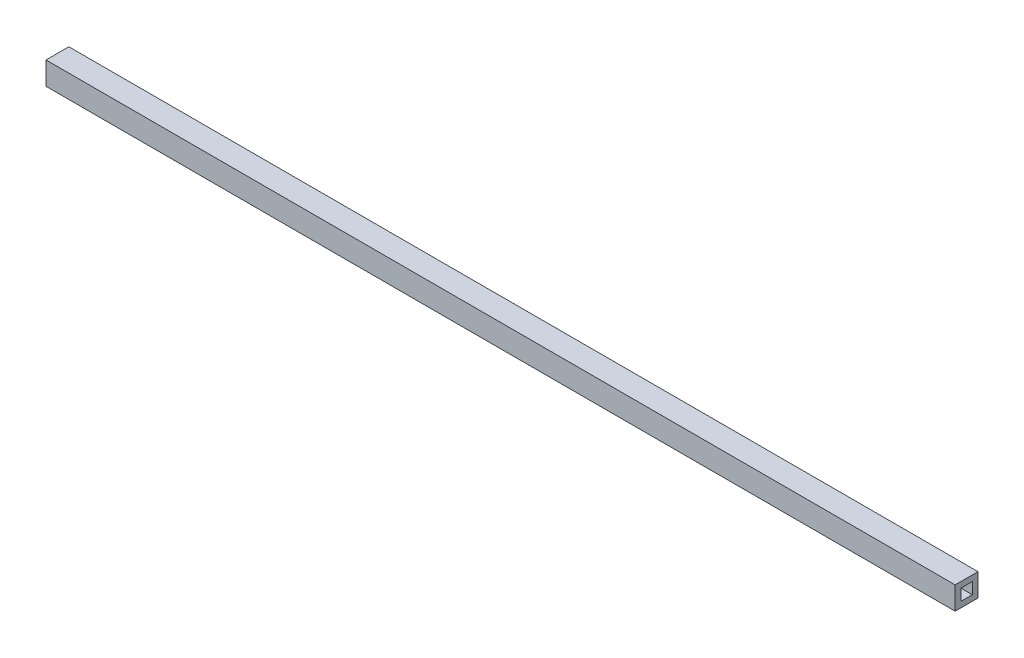
ISO-10303-21;
HEADER;
FILE_DESCRIPTION(('STEP AP214'),'2;1');
FILE_NAME('part.step','',(''),(''),'','','');
FILE_SCHEMA(('AUTOMOTIVE_DESIGN { 1 0 10303 214 1 1 1 1 }'));
ENDSEC;
DATA;
#1=APPLICATION_CONTEXT('core data for automotive mechanical design processes');
#2=APPLICATION_PROTOCOL_DEFINITION('international standard','automotive_design',2000,#1);
#3=PRODUCT_CONTEXT('',#1,'mechanical');
#4=PRODUCT('Part','Part','',(#3));
#5=PRODUCT_RELATED_PRODUCT_CATEGORY('part','',(#4));
#6=PRODUCT_DEFINITION_FORMATION('','',#4);
#7=PRODUCT_DEFINITION_CONTEXT('part definition',#1,'design');
#8=PRODUCT_DEFINITION('design','',#6,#7);
#9=PRODUCT_DEFINITION_SHAPE('','',#8);
#10=(LENGTH_UNIT() NAMED_UNIT(*) SI_UNIT(.MILLI.,.METRE.));
#11=(NAMED_UNIT(*) PLANE_ANGLE_UNIT() SI_UNIT($,.RADIAN.));
#12=(NAMED_UNIT(*) SI_UNIT($,.STERADIAN.) SOLID_ANGLE_UNIT());
#13=UNCERTAINTY_MEASURE_WITH_UNIT(LENGTH_MEASURE(1.E-05),#10,'distance_accuracy_value','');
#14=(GEOMETRIC_REPRESENTATION_CONTEXT(3) GLOBAL_UNCERTAINTY_ASSIGNED_CONTEXT((#13)) GLOBAL_UNIT_ASSIGNED_CONTEXT((#10,
#11,#12)) REPRESENTATION_CONTEXT('',''));
#15=CARTESIAN_POINT('',(0.,0.,0.));
#16=DIRECTION('',(0.,0.,1.));
#17=DIRECTION('',(1.,0.,0.));
#18=AXIS2_PLACEMENT_3D('',#15,#16,#17);
#19=CARTESIAN_POINT('',(796.,-10.,-10.));
#20=DIRECTION('',(0.,0.,1.));
#21=DIRECTION('',(0.,-1.,0.));
#22=AXIS2_PLACEMENT_3D('',#19,#20,#21);
#23=PLANE('',#22);
#24=DIRECTION('',(0.,1.,0.));
#25=VECTOR('',#24,1.);
#26=CARTESIAN_POINT('',(0.,-10.,-10.));
#27=LINE('',#26,#25);
#28=CARTESIAN_POINT('',(0.,-10.,-10.));
#29=VERTEX_POINT('',#28);
#30=CARTESIAN_POINT('',(0.,10.,-10.));
#31=VERTEX_POINT('',#30);
#32=EDGE_CURVE('E184',#29,#31,#27,.T.);
#33=ORIENTED_EDGE('',*,*,#32,.T.);
#34=DIRECTION('',(-1.,0.,0.));
#35=VECTOR('',#34,1.);
#36=CARTESIAN_POINT('',(796.,10.,-10.));
#37=LINE('',#36,#35);
#38=CARTESIAN_POINT('',(796.,10.,-10.));
#39=VERTEX_POINT('',#38);
#40=EDGE_CURVE('E11',#39,#31,#37,.T.);
#41=ORIENTED_EDGE('',*,*,#40,.F.);
#42=DIRECTION('',(0.,1.,0.));
#43=VECTOR('',#42,1.);
#44=CARTESIAN_POINT('',(796.,-10.,-10.));
#45=LINE('',#44,#43);
#46=CARTESIAN_POINT('',(796.,-10.,-10.));
#47=VERTEX_POINT('',#46);
#48=EDGE_CURVE('E190',#47,#39,#45,.T.);
#49=ORIENTED_EDGE('',*,*,#48,.F.);
#50=DIRECTION('',(-1.,0.,0.));
#51=VECTOR('',#50,1.);
#52=CARTESIAN_POINT('',(796.,-10.,-10.));
#53=LINE('',#52,#51);
#54=EDGE_CURVE('E200',#47,#29,#53,.T.);
#55=ORIENTED_EDGE('',*,*,#54,.T.);
#56=EDGE_LOOP('',(#33,#41,#49,#55));
#57=FACE_BOUND('',#56,.T.);
#58=ADVANCED_FACE('F33',(#57),#23,.F.);
#59=CARTESIAN_POINT('',(796.,10.,-10.));
#60=DIRECTION('',(0.,-1.,0.));
#61=DIRECTION('',(0.,0.,-1.));
#62=AXIS2_PLACEMENT_3D('',#59,#60,#61);
#63=PLANE('',#62);
#64=DIRECTION('',(0.,0.,1.));
#65=VECTOR('',#64,1.);
#66=CARTESIAN_POINT('',(0.,10.,-10.));
#67=LINE('',#66,#65);
#68=CARTESIAN_POINT('',(0.,10.,10.));
#69=VERTEX_POINT('',#68);
#70=EDGE_CURVE('E203',#31,#69,#67,.T.);
#71=ORIENTED_EDGE('',*,*,#70,.T.);
#72=DIRECTION('',(-1.,0.,0.));
#73=VECTOR('',#72,1.);
#74=CARTESIAN_POINT('',(796.,10.,10.));
#75=LINE('',#74,#73);
#76=CARTESIAN_POINT('',(796.,10.,10.));
#77=VERTEX_POINT('',#76);
#78=EDGE_CURVE('E40',#77,#69,#75,.T.);
#79=ORIENTED_EDGE('',*,*,#78,.F.);
#80=DIRECTION('',(0.,0.,1.));
#81=VECTOR('',#80,1.);
#82=CARTESIAN_POINT('',(796.,10.,-10.));
#83=LINE('',#82,#81);
#84=EDGE_CURVE('E193',#39,#77,#83,.T.);
#85=ORIENTED_EDGE('',*,*,#84,.F.);
#86=ORIENTED_EDGE('',*,*,#40,.T.);
#87=EDGE_LOOP('',(#71,#79,#85,#86));
#88=FACE_BOUND('',#87,.T.);
#89=ADVANCED_FACE('F233',(#88),#63,.F.);
#90=CARTESIAN_POINT('',(796.,10.,10.));
#91=DIRECTION('',(0.,0.,-1.));
#92=DIRECTION('',(0.,1.,0.));
#93=AXIS2_PLACEMENT_3D('',#90,#91,#92);
#94=PLANE('',#93);
#95=DIRECTION('',(0.,-1.,0.));
#96=VECTOR('',#95,1.);
#97=CARTESIAN_POINT('',(0.,10.,10.));
#98=LINE('',#97,#96);
#99=CARTESIAN_POINT('',(0.,-10.,10.));
#100=VERTEX_POINT('',#99);
#101=EDGE_CURVE('E205',#69,#100,#98,.T.);
#102=ORIENTED_EDGE('',*,*,#101,.T.);
#103=DIRECTION('',(-1.,0.,0.));
#104=VECTOR('',#103,1.);
#105=CARTESIAN_POINT('',(796.,-10.,10.));
#106=LINE('',#105,#104);
#107=CARTESIAN_POINT('',(796.,-10.,10.));
#108=VERTEX_POINT('',#107);
#109=EDGE_CURVE('E210',#108,#100,#106,.T.);
#110=ORIENTED_EDGE('',*,*,#109,.F.);
#111=DIRECTION('',(0.,-1.,0.));
#112=VECTOR('',#111,1.);
#113=CARTESIAN_POINT('',(796.,10.,10.));
#114=LINE('',#113,#112);
#115=EDGE_CURVE('E196',#77,#108,#114,.T.);
#116=ORIENTED_EDGE('',*,*,#115,.F.);
#117=ORIENTED_EDGE('',*,*,#78,.T.);
#118=EDGE_LOOP('',(#102,#110,#116,#117));
#119=FACE_BOUND('',#118,.T.);
#120=ADVANCED_FACE('F217',(#119),#94,.F.);
#121=CARTESIAN_POINT('',(796.,-10.,10.));
#122=DIRECTION('',(0.,1.,0.));
#123=DIRECTION('',(0.,0.,1.));
#124=AXIS2_PLACEMENT_3D('',#121,#122,#123);
#125=PLANE('',#124);
#126=DIRECTION('',(0.,0.,-1.));
#127=VECTOR('',#126,1.);
#128=CARTESIAN_POINT('',(0.,-10.,10.));
#129=LINE('',#128,#127);
#130=EDGE_CURVE('E194',#100,#29,#129,.T.);
#131=ORIENTED_EDGE('',*,*,#130,.T.);
#132=ORIENTED_EDGE('',*,*,#54,.F.);
#133=DIRECTION('',(0.,0.,-1.));
#134=VECTOR('',#133,1.);
#135=CARTESIAN_POINT('',(796.,-10.,10.));
#136=LINE('',#135,#134);
#137=EDGE_CURVE('E198',#108,#47,#136,.T.);
#138=ORIENTED_EDGE('',*,*,#137,.F.);
#139=ORIENTED_EDGE('',*,*,#109,.T.);
#140=EDGE_LOOP('',(#131,#132,#138,#139));
#141=FACE_BOUND('',#140,.T.);
#142=ADVANCED_FACE('F226',(#141),#125,.F.);
#143=CARTESIAN_POINT('',(796.,0.,0.));
#144=DIRECTION('',(1.,0.,0.));
#145=DIRECTION('',(0.,0.,-1.));
#146=AXIS2_PLACEMENT_3D('',#143,#144,#145);
#147=PLANE('',#146);
#148=DIRECTION('',(0.,1.,0.));
#149=VECTOR('',#148,1.);
#150=CARTESIAN_POINT('',(796.,-5.,-5.));
#151=LINE('',#150,#149);
#152=CARTESIAN_POINT('',(796.,-5.,-5.));
#153=VERTEX_POINT('',#152);
#154=CARTESIAN_POINT('',(796.,5.,-5.));
#155=VERTEX_POINT('',#154);
#156=EDGE_CURVE('E55',#153,#155,#151,.T.);
#157=ORIENTED_EDGE('',*,*,#156,.F.);
#158=DIRECTION('',(0.,0.,-1.));
#159=VECTOR('',#158,1.);
#160=CARTESIAN_POINT('',(796.,-5.,5.));
#161=LINE('',#160,#159);
#162=CARTESIAN_POINT('',(796.,-5.,5.));
#163=VERTEX_POINT('',#162);
#164=EDGE_CURVE('E163',#163,#153,#161,.T.);
#165=ORIENTED_EDGE('',*,*,#164,.F.);
#166=DIRECTION('',(0.,-1.,0.));
#167=VECTOR('',#166,1.);
#168=CARTESIAN_POINT('',(796.,5.,5.));
#169=LINE('',#168,#167);
#170=CARTESIAN_POINT('',(796.,5.,5.));
#171=VERTEX_POINT('',#170);
#172=EDGE_CURVE('E177',#171,#163,#169,.T.);
#173=ORIENTED_EDGE('',*,*,#172,.F.);
#174=DIRECTION('',(0.,0.,1.));
#175=VECTOR('',#174,1.);
#176=CARTESIAN_POINT('',(796.,5.,-5.));
#177=LINE('',#176,#175);
#178=EDGE_CURVE('E174',#155,#171,#177,.T.);
#179=ORIENTED_EDGE('',*,*,#178,.F.);
#180=EDGE_LOOP('',(#157,#165,#173,#179));
#181=FACE_BOUND('',#180,.T.);
#182=ORIENTED_EDGE('',*,*,#48,.T.);
#183=ORIENTED_EDGE('',*,*,#84,.T.);
#184=ORIENTED_EDGE('',*,*,#115,.T.);
#185=ORIENTED_EDGE('',*,*,#137,.T.);
#186=EDGE_LOOP('',(#182,#183,#184,#185));
#187=FACE_BOUND('',#186,.T.);
#188=ADVANCED_FACE('F232',(#181,#187),#147,.T.);
#189=CARTESIAN_POINT('',(0.,0.,0.));
#190=DIRECTION('',(1.,0.,0.));
#191=DIRECTION('',(0.,0.,-1.));
#192=AXIS2_PLACEMENT_3D('',#189,#190,#191);
#193=PLANE('',#192);
#194=DIRECTION('',(0.,0.,-1.));
#195=VECTOR('',#194,1.);
#196=CARTESIAN_POINT('',(0.,5.,5.));
#197=LINE('',#196,#195);
#198=CARTESIAN_POINT('',(0.,5.,5.));
#199=VERTEX_POINT('',#198);
#200=CARTESIAN_POINT('',(0.,5.,-5.));
#201=VERTEX_POINT('',#200);
#202=EDGE_CURVE('E150',#199,#201,#197,.T.);
#203=ORIENTED_EDGE('',*,*,#202,.F.);
#204=DIRECTION('',(0.,1.,0.));
#205=VECTOR('',#204,1.);
#206=CARTESIAN_POINT('',(0.,-5.,5.));
#207=LINE('',#206,#205);
#208=CARTESIAN_POINT('',(0.,-5.,5.));
#209=VERTEX_POINT('',#208);
#210=EDGE_CURVE('E47',#209,#199,#207,.T.);
#211=ORIENTED_EDGE('',*,*,#210,.F.);
#212=DIRECTION('',(0.,0.,1.));
#213=VECTOR('',#212,1.);
#214=CARTESIAN_POINT('',(0.,-5.,-5.));
#215=LINE('',#214,#213);
#216=CARTESIAN_POINT('',(0.,-5.,-5.));
#217=VERTEX_POINT('',#216);
#218=EDGE_CURVE('E141',#217,#209,#215,.T.);
#219=ORIENTED_EDGE('',*,*,#218,.F.);
#220=DIRECTION('',(0.,-1.,0.));
#221=VECTOR('',#220,1.);
#222=CARTESIAN_POINT('',(0.,5.,-5.));
#223=LINE('',#222,#221);
#224=EDGE_CURVE('E144',#201,#217,#223,.T.);
#225=ORIENTED_EDGE('',*,*,#224,.F.);
#226=EDGE_LOOP('',(#203,#211,#219,#225));
#227=FACE_BOUND('',#226,.T.);
#228=ORIENTED_EDGE('',*,*,#32,.F.);
#229=ORIENTED_EDGE('',*,*,#130,.F.);
#230=ORIENTED_EDGE('',*,*,#101,.F.);
#231=ORIENTED_EDGE('',*,*,#70,.F.);
#232=EDGE_LOOP('',(#228,#229,#230,#231));
#233=FACE_BOUND('',#232,.T.);
#234=ADVANCED_FACE('F223',(#227,#233),#193,.F.);
#235=CARTESIAN_POINT('',(786.,-5.,-5.));
#236=DIRECTION('',(0.,0.,-1.));
#237=DIRECTION('',(-1.,0.,0.));
#238=AXIS2_PLACEMENT_3D('',#235,#236,#237);
#239=PLANE('',#238);
#240=ORIENTED_EDGE('',*,*,#156,.T.);
#241=DIRECTION('',(1.,0.,0.));
#242=VECTOR('',#241,1.);
#243=CARTESIAN_POINT('',(786.,5.,-5.));
#244=LINE('',#243,#242);
#245=CARTESIAN_POINT('',(786.,5.,-5.));
#246=VERTEX_POINT('',#245);
#247=EDGE_CURVE('E172',#246,#155,#244,.T.);
#248=ORIENTED_EDGE('',*,*,#247,.F.);
#249=DIRECTION('',(0.,1.,0.));
#250=VECTOR('',#249,1.);
#251=CARTESIAN_POINT('',(786.,-5.,-5.));
#252=LINE('',#251,#250);
#253=CARTESIAN_POINT('',(786.,-5.,-5.));
#254=VERTEX_POINT('',#253);
#255=EDGE_CURVE('E159',#254,#246,#252,.T.);
#256=ORIENTED_EDGE('',*,*,#255,.F.);
#257=DIRECTION('',(1.,0.,0.));
#258=VECTOR('',#257,1.);
#259=CARTESIAN_POINT('',(786.,-5.,-5.));
#260=LINE('',#259,#258);
#261=EDGE_CURVE('E182',#254,#153,#260,.T.);
#262=ORIENTED_EDGE('',*,*,#261,.T.);
#263=EDGE_LOOP('',(#240,#248,#256,#262));
#264=FACE_BOUND('',#263,.T.);
#265=ADVANCED_FACE('F245',(#264),#239,.F.);
#266=CARTESIAN_POINT('',(786.,-5.,5.));
#267=DIRECTION('',(0.,-1.,0.));
#268=DIRECTION('',(0.,0.,-1.));
#269=AXIS2_PLACEMENT_3D('',#266,#267,#268);
#270=PLANE('',#269);
#271=ORIENTED_EDGE('',*,*,#164,.T.);
#272=ORIENTED_EDGE('',*,*,#261,.F.);
#273=DIRECTION('',(0.,0.,-1.));
#274=VECTOR('',#273,1.);
#275=CARTESIAN_POINT('',(786.,-5.,5.));
#276=LINE('',#275,#274);
#277=CARTESIAN_POINT('',(786.,-5.,5.));
#278=VERTEX_POINT('',#277);
#279=EDGE_CURVE('E169',#278,#254,#276,.T.);
#280=ORIENTED_EDGE('',*,*,#279,.F.);
#281=DIRECTION('',(1.,0.,0.));
#282=VECTOR('',#281,1.);
#283=CARTESIAN_POINT('',(786.,-5.,5.));
#284=LINE('',#283,#282);
#285=EDGE_CURVE('E185',#278,#163,#284,.T.);
#286=ORIENTED_EDGE('',*,*,#285,.T.);
#287=EDGE_LOOP('',(#271,#272,#280,#286));
#288=FACE_BOUND('',#287,.T.);
#289=ADVANCED_FACE('F252',(#288),#270,.F.);
#290=CARTESIAN_POINT('',(786.,5.,5.));
#291=DIRECTION('',(0.,0.,1.));
#292=DIRECTION('',(0.,-1.,0.));
#293=AXIS2_PLACEMENT_3D('',#290,#291,#292);
#294=PLANE('',#293);
#295=ORIENTED_EDGE('',*,*,#172,.T.);
#296=ORIENTED_EDGE('',*,*,#285,.F.);
#297=DIRECTION('',(0.,-1.,0.));
#298=VECTOR('',#297,1.);
#299=CARTESIAN_POINT('',(786.,5.,5.));
#300=LINE('',#299,#298);
#301=CARTESIAN_POINT('',(786.,5.,5.));
#302=VERTEX_POINT('',#301);
#303=EDGE_CURVE('E166',#302,#278,#300,.T.);
#304=ORIENTED_EDGE('',*,*,#303,.F.);
#305=DIRECTION('',(1.,0.,0.));
#306=VECTOR('',#305,1.);
#307=CARTESIAN_POINT('',(786.,5.,5.));
#308=LINE('',#307,#306);
#309=EDGE_CURVE('E187',#302,#171,#308,.T.);
#310=ORIENTED_EDGE('',*,*,#309,.T.);
#311=EDGE_LOOP('',(#295,#296,#304,#310));
#312=FACE_BOUND('',#311,.T.);
#313=ADVANCED_FACE('F257',(#312),#294,.F.);
#314=CARTESIAN_POINT('',(786.,5.,-5.));
#315=DIRECTION('',(0.,1.,0.));
#316=DIRECTION('',(0.,0.,1.));
#317=AXIS2_PLACEMENT_3D('',#314,#315,#316);
#318=PLANE('',#317);
#319=ORIENTED_EDGE('',*,*,#178,.T.);
#320=ORIENTED_EDGE('',*,*,#309,.F.);
#321=DIRECTION('',(0.,0.,1.));
#322=VECTOR('',#321,1.);
#323=CARTESIAN_POINT('',(786.,5.,-5.));
#324=LINE('',#323,#322);
#325=EDGE_CURVE('E162',#246,#302,#324,.T.);
#326=ORIENTED_EDGE('',*,*,#325,.F.);
#327=ORIENTED_EDGE('',*,*,#247,.T.);
#328=EDGE_LOOP('',(#319,#320,#326,#327));
#329=FACE_BOUND('',#328,.T.);
#330=ADVANCED_FACE('F253',(#329),#318,.F.);
#331=CARTESIAN_POINT('',(786.,0.,0.));
#332=DIRECTION('',(1.,0.,0.));
#333=DIRECTION('',(0.,0.,-1.));
#334=AXIS2_PLACEMENT_3D('',#331,#332,#333);
#335=PLANE('',#334);
#336=ORIENTED_EDGE('',*,*,#255,.T.);
#337=ORIENTED_EDGE('',*,*,#325,.T.);
#338=ORIENTED_EDGE('',*,*,#303,.T.);
#339=ORIENTED_EDGE('',*,*,#279,.T.);
#340=EDGE_LOOP('',(#336,#337,#338,#339));
#341=FACE_BOUND('',#340,.T.);
#342=ADVANCED_FACE('F256',(#341),#335,.T.);
#343=CARTESIAN_POINT('',(10.,-5.,5.));
#344=DIRECTION('',(0.,0.,1.));
#345=DIRECTION('',(0.,-1.,0.));
#346=AXIS2_PLACEMENT_3D('',#343,#344,#345);
#347=PLANE('',#346);
#348=ORIENTED_EDGE('',*,*,#210,.T.);
#349=DIRECTION('',(-1.,0.,0.));
#350=VECTOR('',#349,1.);
#351=CARTESIAN_POINT('',(10.,5.,5.));
#352=LINE('',#351,#350);
#353=CARTESIAN_POINT('',(10.,5.,5.));
#354=VERTEX_POINT('',#353);
#355=EDGE_CURVE('E119',#354,#199,#352,.T.);
#356=ORIENTED_EDGE('',*,*,#355,.F.);
#357=DIRECTION('',(0.,1.,0.));
#358=VECTOR('',#357,1.);
#359=CARTESIAN_POINT('',(10.,-5.,5.));
#360=LINE('',#359,#358);
#361=CARTESIAN_POINT('',(10.,-5.,5.));
#362=VERTEX_POINT('',#361);
#363=EDGE_CURVE('E123',#362,#354,#360,.T.);
#364=ORIENTED_EDGE('',*,*,#363,.F.);
#365=DIRECTION('',(-1.,0.,0.));
#366=VECTOR('',#365,1.);
#367=CARTESIAN_POINT('',(10.,-5.,5.));
#368=LINE('',#367,#366);
#369=EDGE_CURVE('E154',#362,#209,#368,.T.);
#370=ORIENTED_EDGE('',*,*,#369,.T.);
#371=EDGE_LOOP('',(#348,#356,#364,#370));
#372=FACE_BOUND('',#371,.T.);
#373=ADVANCED_FACE('F121',(#372),#347,.F.);
#374=CARTESIAN_POINT('',(10.,-5.,-5.));
#375=DIRECTION('',(0.,-1.,0.));
#376=DIRECTION('',(0.,0.,-1.));
#377=AXIS2_PLACEMENT_3D('',#374,#375,#376);
#378=PLANE('',#377);
#379=ORIENTED_EDGE('',*,*,#218,.T.);
#380=ORIENTED_EDGE('',*,*,#369,.F.);
#381=DIRECTION('',(0.,0.,1.));
#382=VECTOR('',#381,1.);
#383=CARTESIAN_POINT('',(10.,-5.,-5.));
#384=LINE('',#383,#382);
#385=CARTESIAN_POINT('',(10.,-5.,-5.));
#386=VERTEX_POINT('',#385);
#387=EDGE_CURVE('E129',#386,#362,#384,.T.);
#388=ORIENTED_EDGE('',*,*,#387,.F.);
#389=DIRECTION('',(-1.,0.,0.));
#390=VECTOR('',#389,1.);
#391=CARTESIAN_POINT('',(10.,-5.,-5.));
#392=LINE('',#391,#390);
#393=EDGE_CURVE('E156',#386,#217,#392,.T.);
#394=ORIENTED_EDGE('',*,*,#393,.T.);
#395=EDGE_LOOP('',(#379,#380,#388,#394));
#396=FACE_BOUND('',#395,.T.);
#397=ADVANCED_FACE('F270',(#396),#378,.F.);
#398=CARTESIAN_POINT('',(10.,5.,-5.));
#399=DIRECTION('',(0.,0.,-1.));
#400=DIRECTION('',(0.,1.,0.));
#401=AXIS2_PLACEMENT_3D('',#398,#399,#400);
#402=PLANE('',#401);
#403=ORIENTED_EDGE('',*,*,#224,.T.);
#404=ORIENTED_EDGE('',*,*,#393,.F.);
#405=DIRECTION('',(0.,-1.,0.));
#406=VECTOR('',#405,1.);
#407=CARTESIAN_POINT('',(10.,5.,-5.));
#408=LINE('',#407,#406);
#409=CARTESIAN_POINT('',(10.,5.,-5.));
#410=VERTEX_POINT('',#409);
#411=EDGE_CURVE('E137',#410,#386,#408,.T.);
#412=ORIENTED_EDGE('',*,*,#411,.F.);
#413=DIRECTION('',(-1.,0.,0.));
#414=VECTOR('',#413,1.);
#415=CARTESIAN_POINT('',(10.,5.,-5.));
#416=LINE('',#415,#414);
#417=EDGE_CURVE('E128',#410,#201,#416,.T.);
#418=ORIENTED_EDGE('',*,*,#417,.T.);
#419=EDGE_LOOP('',(#403,#404,#412,#418));
#420=FACE_BOUND('',#419,.T.);
#421=ADVANCED_FACE('F273',(#420),#402,.F.);
#422=CARTESIAN_POINT('',(10.,5.,5.));
#423=DIRECTION('',(0.,1.,0.));
#424=DIRECTION('',(0.,0.,1.));
#425=AXIS2_PLACEMENT_3D('',#422,#423,#424);
#426=PLANE('',#425);
#427=ORIENTED_EDGE('',*,*,#202,.T.);
#428=ORIENTED_EDGE('',*,*,#417,.F.);
#429=DIRECTION('',(0.,0.,-1.));
#430=VECTOR('',#429,1.);
#431=CARTESIAN_POINT('',(10.,5.,5.));
#432=LINE('',#431,#430);
#433=EDGE_CURVE('E132',#354,#410,#432,.T.);
#434=ORIENTED_EDGE('',*,*,#433,.F.);
#435=ORIENTED_EDGE('',*,*,#355,.T.);
#436=EDGE_LOOP('',(#427,#428,#434,#435));
#437=FACE_BOUND('',#436,.T.);
#438=ADVANCED_FACE('F133',(#437),#426,.F.);
#439=CARTESIAN_POINT('',(10.,0.,0.));
#440=DIRECTION('',(-1.,0.,0.));
#441=DIRECTION('',(0.,0.,1.));
#442=AXIS2_PLACEMENT_3D('',#439,#440,#441);
#443=PLANE('',#442);
#444=ORIENTED_EDGE('',*,*,#363,.T.);
#445=ORIENTED_EDGE('',*,*,#433,.T.);
#446=ORIENTED_EDGE('',*,*,#411,.T.);
#447=ORIENTED_EDGE('',*,*,#387,.T.);
#448=EDGE_LOOP('',(#444,#445,#446,#447));
#449=FACE_BOUND('',#448,.T.);
#450=ADVANCED_FACE('F139',(#449),#443,.T.);
#451=CLOSED_SHELL('',(#58,#89,#120,#142,#188,#234,#265,#289,#313,#330,#342,#373,#397,#421,#438,#450));
#452=MANIFOLD_SOLID_BREP('B2',#451);
#453=ADVANCED_BREP_SHAPE_REPRESENTATION('',(#18,#452),#14);
#454=SHAPE_DEFINITION_REPRESENTATION(#9,#453);
ENDSEC;
END-ISO-10303-21;
